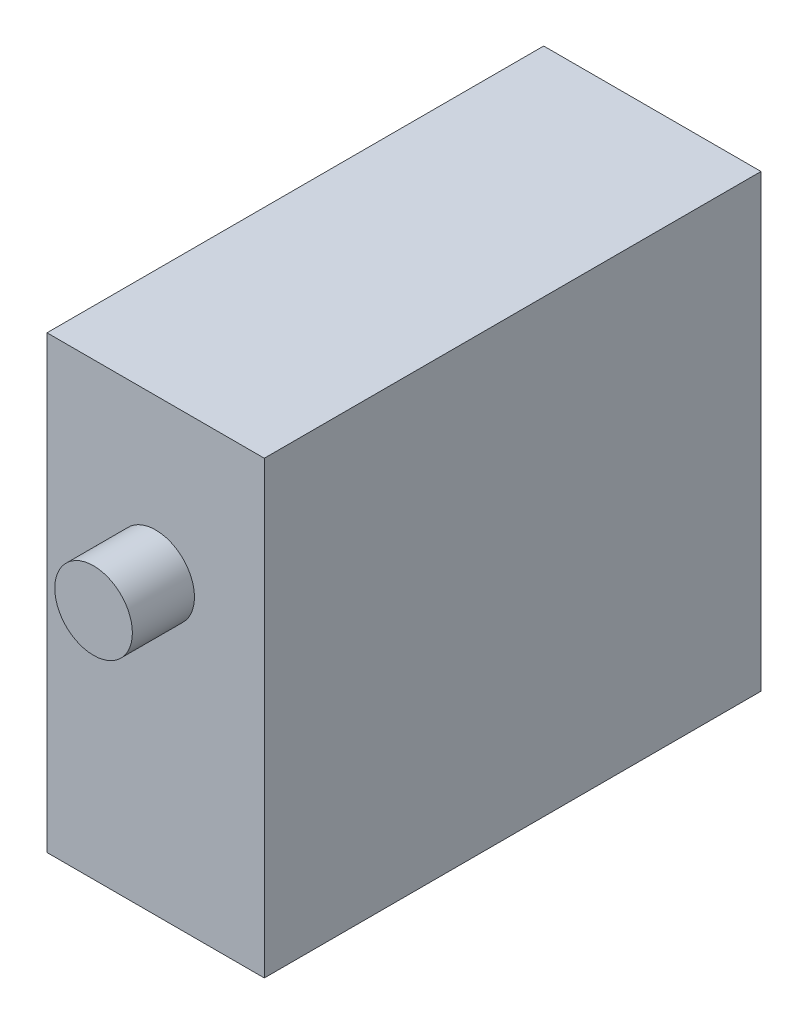
ISO-10303-21;
HEADER;
FILE_DESCRIPTION(('STEP AP214'),'2;1');
FILE_NAME('part.step','',(''),(''),'','','');
FILE_SCHEMA(('AUTOMOTIVE_DESIGN { 1 0 10303 214 1 1 1 1 }'));
ENDSEC;
DATA;
#1=APPLICATION_CONTEXT('core data for automotive mechanical design processes');
#2=APPLICATION_PROTOCOL_DEFINITION('international standard','automotive_design',2000,#1);
#3=PRODUCT_CONTEXT('',#1,'mechanical');
#4=PRODUCT('Part','Part','',(#3));
#5=PRODUCT_RELATED_PRODUCT_CATEGORY('part','',(#4));
#6=PRODUCT_DEFINITION_FORMATION('','',#4);
#7=PRODUCT_DEFINITION_CONTEXT('part definition',#1,'design');
#8=PRODUCT_DEFINITION('design','',#6,#7);
#9=PRODUCT_DEFINITION_SHAPE('','',#8);
#10=(LENGTH_UNIT() NAMED_UNIT(*) SI_UNIT(.MILLI.,.METRE.));
#11=(NAMED_UNIT(*) PLANE_ANGLE_UNIT() SI_UNIT($,.RADIAN.));
#12=(NAMED_UNIT(*) SI_UNIT($,.STERADIAN.) SOLID_ANGLE_UNIT());
#13=UNCERTAINTY_MEASURE_WITH_UNIT(LENGTH_MEASURE(1.E-05),#10,'distance_accuracy_value','');
#14=(GEOMETRIC_REPRESENTATION_CONTEXT(3) GLOBAL_UNCERTAINTY_ASSIGNED_CONTEXT((#13)) GLOBAL_UNIT_ASSIGNED_CONTEXT((#10,
#11,#12)) REPRESENTATION_CONTEXT('',''));
#15=CARTESIAN_POINT('',(0.,0.,0.));
#16=DIRECTION('',(0.,0.,1.));
#17=DIRECTION('',(1.,0.,0.));
#18=AXIS2_PLACEMENT_3D('',#15,#16,#17);
#19=CARTESIAN_POINT('',(0.,0.,32.));
#20=DIRECTION('',(0.,0.,-1.));
#21=DIRECTION('',(-1.,0.,0.));
#22=AXIS2_PLACEMENT_3D('',#19,#20,#21);
#23=PLANE('',#22);
#24=DIRECTION('',(0.,-1.,0.));
#25=VECTOR('',#24,1.);
#26=CARTESIAN_POINT('',(-7.,14.5,32.));
#27=LINE('',#26,#25);
#28=CARTESIAN_POINT('',(-7.,14.5,32.));
#29=VERTEX_POINT('',#28);
#30=CARTESIAN_POINT('',(-7.,-14.5,32.));
#31=VERTEX_POINT('',#30);
#32=EDGE_CURVE('E88',#29,#31,#27,.T.);
#33=ORIENTED_EDGE('',*,*,#32,.T.);
#34=DIRECTION('',(1.,0.,0.));
#35=VECTOR('',#34,1.);
#36=CARTESIAN_POINT('',(7.,-14.5,32.));
#37=LINE('',#36,#35);
#38=CARTESIAN_POINT('',(7.,-14.5,32.));
#39=VERTEX_POINT('',#38);
#40=EDGE_CURVE('E83',#31,#39,#37,.T.);
#41=ORIENTED_EDGE('',*,*,#40,.T.);
#42=DIRECTION('',(0.,1.,0.));
#43=VECTOR('',#42,1.);
#44=CARTESIAN_POINT('',(7.,14.5,32.));
#45=LINE('',#44,#43);
#46=CARTESIAN_POINT('',(7.,14.5,32.));
#47=VERTEX_POINT('',#46);
#48=EDGE_CURVE('E86',#39,#47,#45,.T.);
#49=ORIENTED_EDGE('',*,*,#48,.T.);
#50=DIRECTION('',(-1.,0.,0.));
#51=VECTOR('',#50,1.);
#52=CARTESIAN_POINT('',(7.,14.5,32.));
#53=LINE('',#52,#51);
#54=EDGE_CURVE('E52',#47,#29,#53,.T.);
#55=ORIENTED_EDGE('',*,*,#54,.T.);
#56=EDGE_LOOP('',(#33,#41,#49,#55));
#57=FACE_BOUND('',#56,.T.);
#58=CARTESIAN_POINT('',(0.,4.5,32.));
#59=DIRECTION('',(0.,0.,-1.));
#60=DIRECTION('',(-1.,0.,0.));
#61=AXIS2_PLACEMENT_3D('',#58,#59,#60);
#62=CIRCLE('',#61,2.5);
#63=CARTESIAN_POINT('',(-2.5,4.5,32.));
#64=VERTEX_POINT('',#63);
#65=EDGE_CURVE('E11',#64,#64,#62,.F.);
#66=ORIENTED_EDGE('',*,*,#65,.F.);
#67=EDGE_LOOP('',(#66));
#68=FACE_BOUND('',#67,.T.);
#69=ADVANCED_FACE('F35',(#57,#68),#23,.F.);
#70=CARTESIAN_POINT('',(-7.,14.5,32.));
#71=DIRECTION('',(1.,0.,0.));
#72=DIRECTION('',(0.,1.,0.));
#73=AXIS2_PLACEMENT_3D('',#70,#71,#72);
#74=PLANE('',#73);
#75=DIRECTION('',(0.,-1.,0.));
#76=VECTOR('',#75,1.);
#77=CARTESIAN_POINT('',(-7.,14.5,0.));
#78=LINE('',#77,#76);
#79=CARTESIAN_POINT('',(-7.,14.5,0.));
#80=VERTEX_POINT('',#79);
#81=CARTESIAN_POINT('',(-7.,-14.5,0.));
#82=VERTEX_POINT('',#81);
#83=EDGE_CURVE('E102',#80,#82,#78,.T.);
#84=ORIENTED_EDGE('',*,*,#83,.T.);
#85=DIRECTION('',(0.,0.,-1.));
#86=VECTOR('',#85,1.);
#87=CARTESIAN_POINT('',(-7.,-14.5,32.));
#88=LINE('',#87,#86);
#89=EDGE_CURVE('E44',#31,#82,#88,.T.);
#90=ORIENTED_EDGE('',*,*,#89,.F.);
#91=ORIENTED_EDGE('',*,*,#32,.F.);
#92=DIRECTION('',(0.,0.,-1.));
#93=VECTOR('',#92,1.);
#94=CARTESIAN_POINT('',(-7.,14.5,32.));
#95=LINE('',#94,#93);
#96=EDGE_CURVE('E98',#29,#80,#95,.T.);
#97=ORIENTED_EDGE('',*,*,#96,.T.);
#98=EDGE_LOOP('',(#84,#90,#91,#97));
#99=FACE_BOUND('',#98,.T.);
#100=ADVANCED_FACE('F37',(#99),#74,.F.);
#101=CARTESIAN_POINT('',(7.,-14.5,32.));
#102=DIRECTION('',(0.,1.,0.));
#103=DIRECTION('',(0.,0.,1.));
#104=AXIS2_PLACEMENT_3D('',#101,#102,#103);
#105=PLANE('',#104);
#106=DIRECTION('',(1.,0.,0.));
#107=VECTOR('',#106,1.);
#108=CARTESIAN_POINT('',(7.,-14.5,0.));
#109=LINE('',#108,#107);
#110=CARTESIAN_POINT('',(7.,-14.5,0.));
#111=VERTEX_POINT('',#110);
#112=EDGE_CURVE('E93',#82,#111,#109,.T.);
#113=ORIENTED_EDGE('',*,*,#112,.T.);
#114=DIRECTION('',(0.,0.,-1.));
#115=VECTOR('',#114,1.);
#116=CARTESIAN_POINT('',(7.,-14.5,32.));
#117=LINE('',#116,#115);
#118=EDGE_CURVE('E91',#39,#111,#117,.T.);
#119=ORIENTED_EDGE('',*,*,#118,.F.);
#120=ORIENTED_EDGE('',*,*,#40,.F.);
#121=ORIENTED_EDGE('',*,*,#89,.T.);
#122=EDGE_LOOP('',(#113,#119,#120,#121));
#123=FACE_BOUND('',#122,.T.);
#124=ADVANCED_FACE('F92',(#123),#105,.F.);
#125=CARTESIAN_POINT('',(7.,14.5,32.));
#126=DIRECTION('',(-1.,0.,0.));
#127=DIRECTION('',(0.,-1.,0.));
#128=AXIS2_PLACEMENT_3D('',#125,#126,#127);
#129=PLANE('',#128);
#130=DIRECTION('',(0.,1.,0.));
#131=VECTOR('',#130,1.);
#132=CARTESIAN_POINT('',(7.,14.5,0.));
#133=LINE('',#132,#131);
#134=CARTESIAN_POINT('',(7.,14.5,0.));
#135=VERTEX_POINT('',#134);
#136=EDGE_CURVE('E69',#111,#135,#133,.T.);
#137=ORIENTED_EDGE('',*,*,#136,.T.);
#138=DIRECTION('',(0.,0.,-1.));
#139=VECTOR('',#138,1.);
#140=CARTESIAN_POINT('',(7.,14.5,32.));
#141=LINE('',#140,#139);
#142=EDGE_CURVE('E94',#47,#135,#141,.T.);
#143=ORIENTED_EDGE('',*,*,#142,.F.);
#144=ORIENTED_EDGE('',*,*,#48,.F.);
#145=ORIENTED_EDGE('',*,*,#118,.T.);
#146=EDGE_LOOP('',(#137,#143,#144,#145));
#147=FACE_BOUND('',#146,.T.);
#148=ADVANCED_FACE('F96',(#147),#129,.F.);
#149=CARTESIAN_POINT('',(7.,14.5,32.));
#150=DIRECTION('',(0.,-1.,0.));
#151=DIRECTION('',(0.,0.,-1.));
#152=AXIS2_PLACEMENT_3D('',#149,#150,#151);
#153=PLANE('',#152);
#154=DIRECTION('',(-1.,0.,0.));
#155=VECTOR('',#154,1.);
#156=CARTESIAN_POINT('',(7.,14.5,0.));
#157=LINE('',#156,#155);
#158=EDGE_CURVE('E75',#135,#80,#157,.T.);
#159=ORIENTED_EDGE('',*,*,#158,.T.);
#160=ORIENTED_EDGE('',*,*,#96,.F.);
#161=ORIENTED_EDGE('',*,*,#54,.F.);
#162=ORIENTED_EDGE('',*,*,#142,.T.);
#163=EDGE_LOOP('',(#159,#160,#161,#162));
#164=FACE_BOUND('',#163,.T.);
#165=ADVANCED_FACE('F116',(#164),#153,.F.);
#166=CARTESIAN_POINT('',(0.,0.,0.));
#167=DIRECTION('',(0.,0.,-1.));
#168=DIRECTION('',(-1.,0.,0.));
#169=AXIS2_PLACEMENT_3D('',#166,#167,#168);
#170=PLANE('',#169);
#171=ORIENTED_EDGE('',*,*,#83,.F.);
#172=ORIENTED_EDGE('',*,*,#158,.F.);
#173=ORIENTED_EDGE('',*,*,#136,.F.);
#174=ORIENTED_EDGE('',*,*,#112,.F.);
#175=EDGE_LOOP('',(#171,#172,#173,#174));
#176=FACE_BOUND('',#175,.T.);
#177=ADVANCED_FACE('F113',(#176),#170,.T.);
#178=CARTESIAN_POINT('',(0.,4.5,36.));
#179=DIRECTION('',(0.,0.,-1.));
#180=DIRECTION('',(-1.,0.,0.));
#181=AXIS2_PLACEMENT_3D('',#178,#179,#180);
#182=CYLINDRICAL_SURFACE('',#181,2.5);
#183=CARTESIAN_POINT('',(0.,4.5,36.));
#184=DIRECTION('',(0.,0.,1.));
#185=DIRECTION('',(1.,0.,0.));
#186=AXIS2_PLACEMENT_3D('',#183,#184,#185);
#187=CIRCLE('',#186,2.5);
#188=CARTESIAN_POINT('',(2.5,4.5,36.));
#189=VERTEX_POINT('',#188);
#190=EDGE_CURVE('E105',#189,#189,#187,.T.);
#191=ORIENTED_EDGE('',*,*,#190,.F.);
#192=EDGE_LOOP('',(#191));
#193=FACE_BOUND('',#192,.T.);
#194=ORIENTED_EDGE('',*,*,#65,.T.);
#195=EDGE_LOOP('',(#194));
#196=FACE_BOUND('',#195,.T.);
#197=ADVANCED_FACE('F115',(#193,#196),#182,.T.);
#198=CARTESIAN_POINT('',(0.,4.5,36.));
#199=DIRECTION('',(0.,0.,1.));
#200=DIRECTION('',(1.,0.,0.));
#201=AXIS2_PLACEMENT_3D('',#198,#199,#200);
#202=PLANE('',#201);
#203=ORIENTED_EDGE('',*,*,#190,.T.);
#204=EDGE_LOOP('',(#203));
#205=FACE_BOUND('',#204,.T.);
#206=ADVANCED_FACE('F122',(#205),#202,.T.);
#207=CLOSED_SHELL('',(#69,#100,#124,#148,#165,#177,#197,#206));
#208=MANIFOLD_SOLID_BREP('B2',#207);
#209=ADVANCED_BREP_SHAPE_REPRESENTATION('',(#18,#208),#14);
#210=SHAPE_DEFINITION_REPRESENTATION(#9,#209);
ENDSEC;
END-ISO-10303-21;
